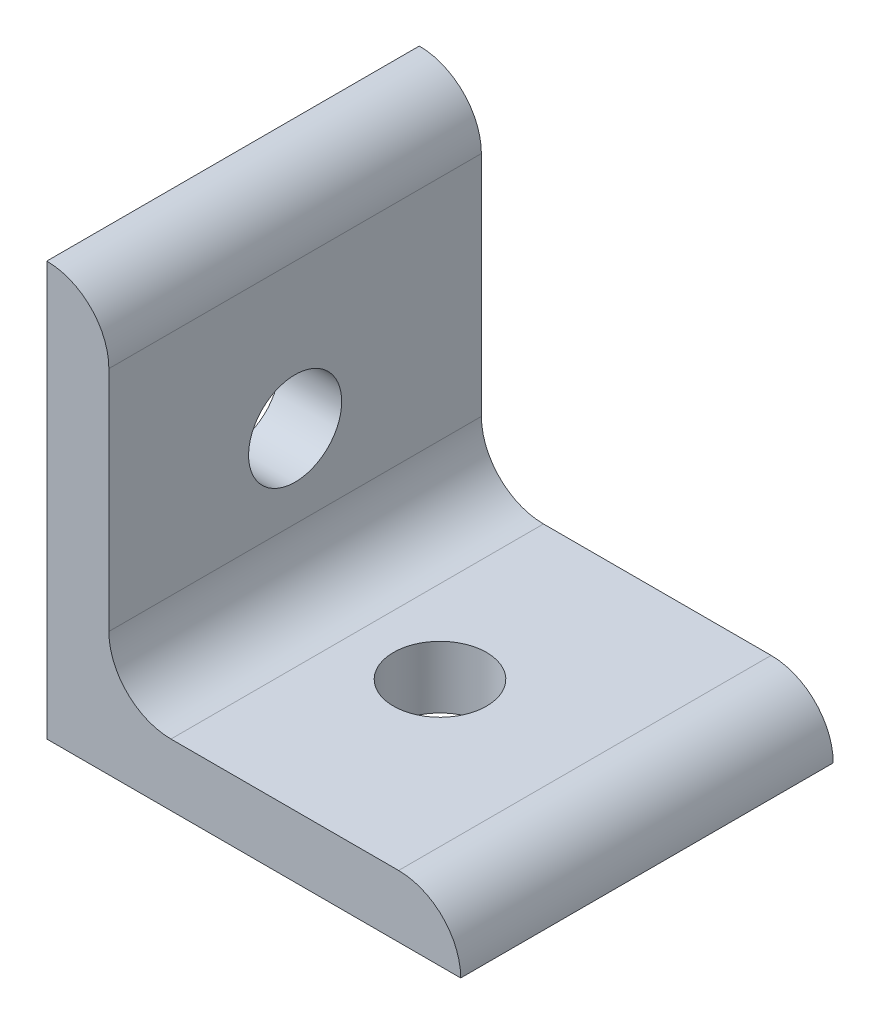
ISO-10303-21;
HEADER;
FILE_DESCRIPTION(('STEP AP214'),'2;1');
FILE_NAME('part.step','',(''),(''),'','','');
FILE_SCHEMA(('AUTOMOTIVE_DESIGN { 1 0 10303 214 1 1 1 1 }'));
ENDSEC;
DATA;
#1=APPLICATION_CONTEXT('core data for automotive mechanical design processes');
#2=APPLICATION_PROTOCOL_DEFINITION('international standard','automotive_design',2000,#1);
#3=PRODUCT_CONTEXT('',#1,'mechanical');
#4=PRODUCT('Part','Part','',(#3));
#5=PRODUCT_RELATED_PRODUCT_CATEGORY('part','',(#4));
#6=PRODUCT_DEFINITION_FORMATION('','',#4);
#7=PRODUCT_DEFINITION_CONTEXT('part definition',#1,'design');
#8=PRODUCT_DEFINITION('design','',#6,#7);
#9=PRODUCT_DEFINITION_SHAPE('','',#8);
#10=(LENGTH_UNIT() NAMED_UNIT(*) SI_UNIT(.MILLI.,.METRE.));
#11=(NAMED_UNIT(*) PLANE_ANGLE_UNIT() SI_UNIT($,.RADIAN.));
#12=(NAMED_UNIT(*) SI_UNIT($,.STERADIAN.) SOLID_ANGLE_UNIT());
#13=UNCERTAINTY_MEASURE_WITH_UNIT(LENGTH_MEASURE(1.E-05),#10,'distance_accuracy_value','');
#14=(GEOMETRIC_REPRESENTATION_CONTEXT(3) GLOBAL_UNCERTAINTY_ASSIGNED_CONTEXT((#13)) GLOBAL_UNIT_ASSIGNED_CONTEXT((#10,
#11,#12)) REPRESENTATION_CONTEXT('',''));
#15=CARTESIAN_POINT('',(0.,0.,0.));
#16=DIRECTION('',(0.,0.,1.));
#17=DIRECTION('',(1.,0.,0.));
#18=AXIS2_PLACEMENT_3D('',#15,#16,#17);
#19=CARTESIAN_POINT('',(6.,34.,18.));
#20=DIRECTION('',(-1.,0.,0.));
#21=DIRECTION('',(0.,-1.,0.));
#22=AXIS2_PLACEMENT_3D('',#19,#20,#21);
#23=PLANE('',#22);
#24=DIRECTION('',(0.,1.,0.));
#25=VECTOR('',#24,1.);
#26=CARTESIAN_POINT('',(6.,34.,-18.));
#27=LINE('',#26,#25);
#28=CARTESIAN_POINT('',(6.,12.,-18.));
#29=VERTEX_POINT('',#28);
#30=CARTESIAN_POINT('',(6.,34.,-18.));
#31=VERTEX_POINT('',#30);
#32=EDGE_CURVE('E113',#29,#31,#27,.T.);
#33=ORIENTED_EDGE('',*,*,#32,.T.);
#34=DIRECTION('',(0.,0.,-1.));
#35=VECTOR('',#34,1.);
#36=CARTESIAN_POINT('',(6.,34.,18.));
#37=LINE('',#36,#35);
#38=CARTESIAN_POINT('',(6.,34.,18.));
#39=VERTEX_POINT('',#38);
#40=EDGE_CURVE('E110',#39,#31,#37,.T.);
#41=ORIENTED_EDGE('',*,*,#40,.F.);
#42=DIRECTION('',(0.,1.,0.));
#43=VECTOR('',#42,1.);
#44=CARTESIAN_POINT('',(6.,34.,18.));
#45=LINE('',#44,#43);
#46=CARTESIAN_POINT('',(6.,12.,18.));
#47=VERTEX_POINT('',#46);
#48=EDGE_CURVE('E99',#47,#39,#45,.T.);
#49=ORIENTED_EDGE('',*,*,#48,.F.);
#50=DIRECTION('',(0.,0.,-1.));
#51=VECTOR('',#50,1.);
#52=CARTESIAN_POINT('',(6.,12.,18.));
#53=LINE('',#52,#51);
#54=EDGE_CURVE('E114',#47,#29,#53,.T.);
#55=ORIENTED_EDGE('',*,*,#54,.T.);
#56=EDGE_LOOP('',(#33,#41,#49,#55));
#57=FACE_BOUND('',#56,.T.);
#58=CARTESIAN_POINT('',(6.,20.,0.));
#59=DIRECTION('',(-1.,0.,0.));
#60=DIRECTION('',(0.,-1.,0.));
#61=AXIS2_PLACEMENT_3D('',#58,#59,#60);
#62=CIRCLE('',#61,4.5);
#63=CARTESIAN_POINT('',(6.,15.5,0.));
#64=VERTEX_POINT('',#63);
#65=EDGE_CURVE('E163',#64,#64,#62,.F.);
#66=ORIENTED_EDGE('',*,*,#65,.F.);
#67=EDGE_LOOP('',(#66));
#68=FACE_BOUND('',#67,.T.);
#69=ADVANCED_FACE('F31',(#57,#68),#23,.F.);
#70=CARTESIAN_POINT('',(0.,0.,18.));
#71=DIRECTION('',(1.,0.,0.));
#72=DIRECTION('',(0.,0.,-1.));
#73=AXIS2_PLACEMENT_3D('',#70,#71,#72);
#74=PLANE('',#73);
#75=DIRECTION('',(0.,-1.,0.));
#76=VECTOR('',#75,1.);
#77=CARTESIAN_POINT('',(0.,0.,-18.));
#78=LINE('',#77,#76);
#79=CARTESIAN_POINT('',(0.,40.,-18.));
#80=VERTEX_POINT('',#79);
#81=CARTESIAN_POINT('',(0.,0.,-18.));
#82=VERTEX_POINT('',#81);
#83=EDGE_CURVE('E81',#80,#82,#78,.T.);
#84=ORIENTED_EDGE('',*,*,#83,.T.);
#85=DIRECTION('',(0.,0.,-1.));
#86=VECTOR('',#85,1.);
#87=CARTESIAN_POINT('',(0.,0.,18.));
#88=LINE('',#87,#86);
#89=CARTESIAN_POINT('',(0.,0.,18.));
#90=VERTEX_POINT('',#89);
#91=EDGE_CURVE('E119',#90,#82,#88,.T.);
#92=ORIENTED_EDGE('',*,*,#91,.F.);
#93=DIRECTION('',(0.,-1.,0.));
#94=VECTOR('',#93,1.);
#95=CARTESIAN_POINT('',(0.,0.,18.));
#96=LINE('',#95,#94);
#97=CARTESIAN_POINT('',(0.,40.,18.));
#98=VERTEX_POINT('',#97);
#99=EDGE_CURVE('E49',#98,#90,#96,.T.);
#100=ORIENTED_EDGE('',*,*,#99,.F.);
#101=DIRECTION('',(0.,0.,-1.));
#102=VECTOR('',#101,1.);
#103=CARTESIAN_POINT('',(0.,40.,18.));
#104=LINE('',#103,#102);
#105=EDGE_CURVE('E115',#98,#80,#104,.T.);
#106=ORIENTED_EDGE('',*,*,#105,.T.);
#107=EDGE_LOOP('',(#84,#92,#100,#106));
#108=FACE_BOUND('',#107,.T.);
#109=CARTESIAN_POINT('',(0.,20.,0.));
#110=DIRECTION('',(1.,0.,0.));
#111=DIRECTION('',(0.,0.,-1.));
#112=AXIS2_PLACEMENT_3D('',#109,#110,#111);
#113=CIRCLE('',#112,4.5);
#114=CARTESIAN_POINT('',(0.,20.,-4.5));
#115=VERTEX_POINT('',#114);
#116=EDGE_CURVE('E166',#115,#115,#113,.T.);
#117=ORIENTED_EDGE('',*,*,#116,.T.);
#118=EDGE_LOOP('',(#117));
#119=FACE_BOUND('',#118,.T.);
#120=ADVANCED_FACE('F170',(#108,#119),#74,.F.);
#121=CARTESIAN_POINT('',(40.,0.,18.));
#122=DIRECTION('',(0.,1.,0.));
#123=DIRECTION('',(-1.,0.,0.));
#124=AXIS2_PLACEMENT_3D('',#121,#122,#123);
#125=PLANE('',#124);
#126=DIRECTION('',(1.,0.,0.));
#127=VECTOR('',#126,1.);
#128=CARTESIAN_POINT('',(40.,0.,-18.));
#129=LINE('',#128,#127);
#130=CARTESIAN_POINT('',(40.,0.,-18.));
#131=VERTEX_POINT('',#130);
#132=EDGE_CURVE('E123',#82,#131,#129,.T.);
#133=ORIENTED_EDGE('',*,*,#132,.T.);
#134=DIRECTION('',(0.,0.,-1.));
#135=VECTOR('',#134,1.);
#136=CARTESIAN_POINT('',(40.,0.,18.));
#137=LINE('',#136,#135);
#138=CARTESIAN_POINT('',(40.,0.,18.));
#139=VERTEX_POINT('',#138);
#140=EDGE_CURVE('E11',#139,#131,#137,.T.);
#141=ORIENTED_EDGE('',*,*,#140,.F.);
#142=DIRECTION('',(1.,0.,0.));
#143=VECTOR('',#142,1.);
#144=CARTESIAN_POINT('',(40.,0.,18.));
#145=LINE('',#144,#143);
#146=EDGE_CURVE('E135',#90,#139,#145,.T.);
#147=ORIENTED_EDGE('',*,*,#146,.F.);
#148=ORIENTED_EDGE('',*,*,#91,.T.);
#149=EDGE_LOOP('',(#133,#141,#147,#148));
#150=FACE_BOUND('',#149,.T.);
#151=CARTESIAN_POINT('',(20.,0.,0.));
#152=DIRECTION('',(0.,1.,0.));
#153=DIRECTION('',(0.,0.,1.));
#154=AXIS2_PLACEMENT_3D('',#151,#152,#153);
#155=CIRCLE('',#154,4.5);
#156=CARTESIAN_POINT('',(20.,0.,4.5));
#157=VERTEX_POINT('',#156);
#158=EDGE_CURVE('E160',#157,#157,#155,.T.);
#159=ORIENTED_EDGE('',*,*,#158,.T.);
#160=EDGE_LOOP('',(#159));
#161=FACE_BOUND('',#160,.T.);
#162=ADVANCED_FACE('F33',(#150,#161),#125,.F.);
#163=CARTESIAN_POINT('',(12.,6.,18.));
#164=DIRECTION('',(0.,-1.,0.));
#165=DIRECTION('',(0.,0.,-1.));
#166=AXIS2_PLACEMENT_3D('',#163,#164,#165);
#167=PLANE('',#166);
#168=DIRECTION('',(-1.,0.,0.));
#169=VECTOR('',#168,1.);
#170=CARTESIAN_POINT('',(12.,6.,-18.));
#171=LINE('',#170,#169);
#172=CARTESIAN_POINT('',(34.,6.,-18.));
#173=VERTEX_POINT('',#172);
#174=CARTESIAN_POINT('',(12.,6.,-18.));
#175=VERTEX_POINT('',#174);
#176=EDGE_CURVE('E128',#173,#175,#171,.T.);
#177=ORIENTED_EDGE('',*,*,#176,.T.);
#178=DIRECTION('',(0.,0.,-1.));
#179=VECTOR('',#178,1.);
#180=CARTESIAN_POINT('',(12.,6.,18.));
#181=LINE('',#180,#179);
#182=CARTESIAN_POINT('',(12.,6.,18.));
#183=VERTEX_POINT('',#182);
#184=EDGE_CURVE('E139',#183,#175,#181,.T.);
#185=ORIENTED_EDGE('',*,*,#184,.F.);
#186=DIRECTION('',(-1.,0.,0.));
#187=VECTOR('',#186,1.);
#188=CARTESIAN_POINT('',(12.,6.,18.));
#189=LINE('',#188,#187);
#190=CARTESIAN_POINT('',(34.,6.,18.));
#191=VERTEX_POINT('',#190);
#192=EDGE_CURVE('E149',#191,#183,#189,.T.);
#193=ORIENTED_EDGE('',*,*,#192,.F.);
#194=DIRECTION('',(0.,0.,-1.));
#195=VECTOR('',#194,1.);
#196=CARTESIAN_POINT('',(34.,6.,18.));
#197=LINE('',#196,#195);
#198=EDGE_CURVE('E41',#191,#173,#197,.T.);
#199=ORIENTED_EDGE('',*,*,#198,.T.);
#200=EDGE_LOOP('',(#177,#185,#193,#199));
#201=FACE_BOUND('',#200,.T.);
#202=CARTESIAN_POINT('',(20.,6.00000000000001,0.));
#203=DIRECTION('',(0.,-1.,0.));
#204=DIRECTION('',(0.,0.,-1.));
#205=AXIS2_PLACEMENT_3D('',#202,#203,#204);
#206=CIRCLE('',#205,4.5);
#207=CARTESIAN_POINT('',(20.,6.00000000000001,-4.5));
#208=VERTEX_POINT('',#207);
#209=EDGE_CURVE('E35',#208,#208,#206,.F.);
#210=ORIENTED_EDGE('',*,*,#209,.F.);
#211=EDGE_LOOP('',(#210));
#212=FACE_BOUND('',#211,.T.);
#213=ADVANCED_FACE('F146',(#201,#212),#167,.F.);
#214=CARTESIAN_POINT('',(34.,0.,18.));
#215=DIRECTION('',(0.,0.,-1.));
#216=DIRECTION('',(-1.,0.,0.));
#217=AXIS2_PLACEMENT_3D('',#214,#215,#216);
#218=CYLINDRICAL_SURFACE('',#217,6.);
#219=CARTESIAN_POINT('',(34.,0.,-18.));
#220=DIRECTION('',(0.,0.,1.));
#221=DIRECTION('',(1.,0.,0.));
#222=AXIS2_PLACEMENT_3D('',#219,#220,#221);
#223=CIRCLE('',#222,6.);
#224=EDGE_CURVE('E126',#131,#173,#223,.T.);
#225=ORIENTED_EDGE('',*,*,#224,.T.);
#226=ORIENTED_EDGE('',*,*,#198,.F.);
#227=CARTESIAN_POINT('',(34.,0.,18.));
#228=DIRECTION('',(0.,0.,1.));
#229=DIRECTION('',(1.,0.,0.));
#230=AXIS2_PLACEMENT_3D('',#227,#228,#229);
#231=CIRCLE('',#230,6.);
#232=EDGE_CURVE('E89',#139,#191,#231,.T.);
#233=ORIENTED_EDGE('',*,*,#232,.F.);
#234=ORIENTED_EDGE('',*,*,#140,.T.);
#235=EDGE_LOOP('',(#225,#226,#233,#234));
#236=FACE_BOUND('',#235,.T.);
#237=ADVANCED_FACE('F188',(#236),#218,.T.);
#238=CARTESIAN_POINT('',(12.,12.,18.));
#239=DIRECTION('',(0.,0.,-1.));
#240=DIRECTION('',(-1.,0.,0.));
#241=AXIS2_PLACEMENT_3D('',#238,#239,#240);
#242=CYLINDRICAL_SURFACE('',#241,6.);
#243=CARTESIAN_POINT('',(12.,12.,-18.));
#244=DIRECTION('',(0.,0.,-1.));
#245=DIRECTION('',(1.,0.,0.));
#246=AXIS2_PLACEMENT_3D('',#243,#244,#245);
#247=CIRCLE('',#246,6.);
#248=EDGE_CURVE('E130',#175,#29,#247,.T.);
#249=ORIENTED_EDGE('',*,*,#248,.T.);
#250=ORIENTED_EDGE('',*,*,#54,.F.);
#251=CARTESIAN_POINT('',(12.,12.,18.));
#252=DIRECTION('',(0.,0.,-1.));
#253=DIRECTION('',(1.,0.,0.));
#254=AXIS2_PLACEMENT_3D('',#251,#252,#253);
#255=CIRCLE('',#254,6.);
#256=EDGE_CURVE('E105',#183,#47,#255,.T.);
#257=ORIENTED_EDGE('',*,*,#256,.F.);
#258=ORIENTED_EDGE('',*,*,#184,.T.);
#259=EDGE_LOOP('',(#249,#250,#257,#258));
#260=FACE_BOUND('',#259,.T.);
#261=ADVANCED_FACE('F155',(#260),#242,.F.);
#262=CARTESIAN_POINT('',(0.,34.,18.));
#263=DIRECTION('',(0.,0.,-1.));
#264=DIRECTION('',(-1.,0.,0.));
#265=AXIS2_PLACEMENT_3D('',#262,#263,#264);
#266=CYLINDRICAL_SURFACE('',#265,6.);
#267=CARTESIAN_POINT('',(0.,34.,-18.));
#268=DIRECTION('',(0.,0.,1.));
#269=DIRECTION('',(1.,0.,0.));
#270=AXIS2_PLACEMENT_3D('',#267,#268,#269);
#271=CIRCLE('',#270,6.);
#272=EDGE_CURVE('E75',#31,#80,#271,.T.);
#273=ORIENTED_EDGE('',*,*,#272,.T.);
#274=ORIENTED_EDGE('',*,*,#105,.F.);
#275=CARTESIAN_POINT('',(0.,34.,18.));
#276=DIRECTION('',(0.,0.,1.));
#277=DIRECTION('',(1.,0.,0.));
#278=AXIS2_PLACEMENT_3D('',#275,#276,#277);
#279=CIRCLE('',#278,6.);
#280=EDGE_CURVE('E103',#39,#98,#279,.T.);
#281=ORIENTED_EDGE('',*,*,#280,.F.);
#282=ORIENTED_EDGE('',*,*,#40,.T.);
#283=EDGE_LOOP('',(#273,#274,#281,#282));
#284=FACE_BOUND('',#283,.T.);
#285=ADVANCED_FACE('F117',(#284),#266,.T.);
#286=CARTESIAN_POINT('',(0.,34.,18.));
#287=DIRECTION('',(0.,0.,1.));
#288=DIRECTION('',(1.,0.,0.));
#289=AXIS2_PLACEMENT_3D('',#286,#287,#288);
#290=PLANE('',#289);
#291=ORIENTED_EDGE('',*,*,#146,.T.);
#292=ORIENTED_EDGE('',*,*,#232,.T.);
#293=ORIENTED_EDGE('',*,*,#192,.T.);
#294=ORIENTED_EDGE('',*,*,#256,.T.);
#295=ORIENTED_EDGE('',*,*,#48,.T.);
#296=ORIENTED_EDGE('',*,*,#280,.T.);
#297=ORIENTED_EDGE('',*,*,#99,.T.);
#298=EDGE_LOOP('',(#291,#292,#293,#294,#295,#296,#297));
#299=FACE_BOUND('',#298,.T.);
#300=ADVANCED_FACE('F101',(#299),#290,.T.);
#301=CARTESIAN_POINT('',(0.,34.,-18.));
#302=DIRECTION('',(0.,0.,1.));
#303=DIRECTION('',(1.,0.,0.));
#304=AXIS2_PLACEMENT_3D('',#301,#302,#303);
#305=PLANE('',#304);
#306=ORIENTED_EDGE('',*,*,#132,.F.);
#307=ORIENTED_EDGE('',*,*,#83,.F.);
#308=ORIENTED_EDGE('',*,*,#272,.F.);
#309=ORIENTED_EDGE('',*,*,#32,.F.);
#310=ORIENTED_EDGE('',*,*,#248,.F.);
#311=ORIENTED_EDGE('',*,*,#176,.F.);
#312=ORIENTED_EDGE('',*,*,#224,.F.);
#313=EDGE_LOOP('',(#306,#307,#308,#309,#310,#311,#312));
#314=FACE_BOUND('',#313,.T.);
#315=ADVANCED_FACE('F153',(#314),#305,.F.);
#316=CARTESIAN_POINT('',(20.,40.,0.));
#317=DIRECTION('',(0.,-1.,0.));
#318=DIRECTION('',(0.,0.,-1.));
#319=AXIS2_PLACEMENT_3D('',#316,#317,#318);
#320=CYLINDRICAL_SURFACE('',#319,4.5);
#321=ORIENTED_EDGE('',*,*,#158,.F.);
#322=EDGE_LOOP('',(#321));
#323=FACE_BOUND('',#322,.T.);
#324=ORIENTED_EDGE('',*,*,#209,.T.);
#325=EDGE_LOOP('',(#324));
#326=FACE_BOUND('',#325,.T.);
#327=ADVANCED_FACE('F175',(#323,#326),#320,.F.);
#328=CARTESIAN_POINT('',(40.,20.,0.));
#329=DIRECTION('',(-1.,0.,0.));
#330=DIRECTION('',(0.,0.,1.));
#331=AXIS2_PLACEMENT_3D('',#328,#329,#330);
#332=CYLINDRICAL_SURFACE('',#331,4.5);
#333=ORIENTED_EDGE('',*,*,#116,.F.);
#334=EDGE_LOOP('',(#333));
#335=FACE_BOUND('',#334,.T.);
#336=ORIENTED_EDGE('',*,*,#65,.T.);
#337=EDGE_LOOP('',(#336));
#338=FACE_BOUND('',#337,.T.);
#339=ADVANCED_FACE('F172',(#335,#338),#332,.F.);
#340=CLOSED_SHELL('',(#69,#120,#162,#213,#237,#261,#285,#300,#315,#327,#339));
#341=MANIFOLD_SOLID_BREP('B2',#340);
#342=ADVANCED_BREP_SHAPE_REPRESENTATION('',(#18,#341),#14);
#343=SHAPE_DEFINITION_REPRESENTATION(#9,#342);
ENDSEC;
END-ISO-10303-21;
